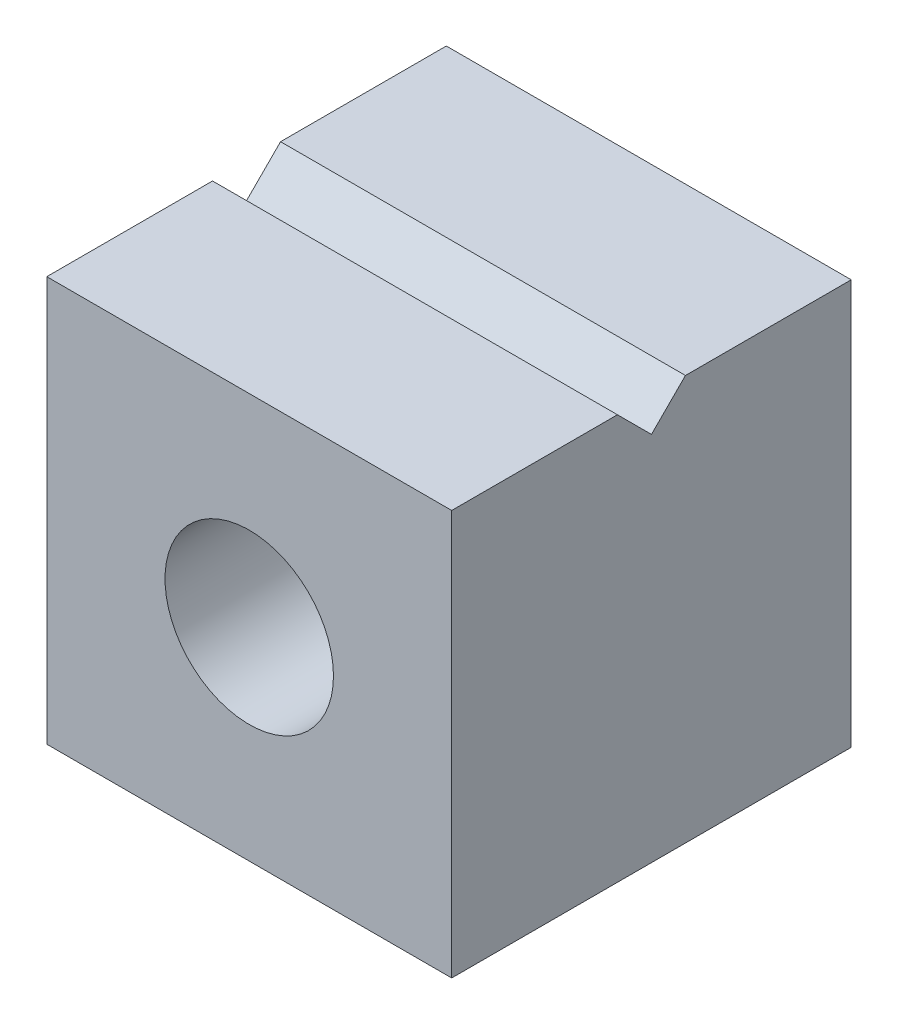
ISO-10303-21;
HEADER;
FILE_DESCRIPTION(('STEP AP214'),'2;1');
FILE_NAME('part.step','',(''),(''),'','','');
FILE_SCHEMA(('AUTOMOTIVE_DESIGN { 1 0 10303 214 1 1 1 1 }'));
ENDSEC;
DATA;
#1=APPLICATION_CONTEXT('core data for automotive mechanical design processes');
#2=APPLICATION_PROTOCOL_DEFINITION('international standard','automotive_design',2000,#1);
#3=PRODUCT_CONTEXT('',#1,'mechanical');
#4=PRODUCT('Part','Part','',(#3));
#5=PRODUCT_RELATED_PRODUCT_CATEGORY('part','',(#4));
#6=PRODUCT_DEFINITION_FORMATION('','',#4);
#7=PRODUCT_DEFINITION_CONTEXT('part definition',#1,'design');
#8=PRODUCT_DEFINITION('design','',#6,#7);
#9=PRODUCT_DEFINITION_SHAPE('','',#8);
#10=(LENGTH_UNIT() NAMED_UNIT(*) SI_UNIT(.MILLI.,.METRE.));
#11=(NAMED_UNIT(*) PLANE_ANGLE_UNIT() SI_UNIT($,.RADIAN.));
#12=(NAMED_UNIT(*) SI_UNIT($,.STERADIAN.) SOLID_ANGLE_UNIT());
#13=UNCERTAINTY_MEASURE_WITH_UNIT(LENGTH_MEASURE(1.E-05),#10,'distance_accuracy_value','');
#14=(GEOMETRIC_REPRESENTATION_CONTEXT(3) GLOBAL_UNCERTAINTY_ASSIGNED_CONTEXT((#13)) GLOBAL_UNIT_ASSIGNED_CONTEXT((#10,
#11,#12)) REPRESENTATION_CONTEXT('',''));
#15=CARTESIAN_POINT('',(0.,0.,0.));
#16=DIRECTION('',(0.,0.,1.));
#17=DIRECTION('',(1.,0.,0.));
#18=AXIS2_PLACEMENT_3D('',#15,#16,#17);
#19=CARTESIAN_POINT('',(-3.75,3.75,7.4));
#20=DIRECTION('',(0.,-1.,0.));
#21=DIRECTION('',(0.,0.,-1.));
#22=AXIS2_PLACEMENT_3D('',#19,#20,#21);
#23=PLANE('',#22);
#24=DIRECTION('',(0.,0.,-1.));
#25=VECTOR('',#24,1.);
#26=CARTESIAN_POINT('',(-3.75,3.75,7.4));
#27=LINE('',#26,#25);
#28=CARTESIAN_POINT('',(-3.75,3.75,3.07));
#29=VERTEX_POINT('',#28);
#30=CARTESIAN_POINT('',(-3.75,3.75,0.));
#31=VERTEX_POINT('',#30);
#32=EDGE_CURVE('E120',#29,#31,#27,.T.);
#33=ORIENTED_EDGE('',*,*,#32,.F.);
#34=DIRECTION('',(1.,0.,0.));
#35=VECTOR('',#34,1.);
#36=CARTESIAN_POINT('',(-3.75,3.75,3.07));
#37=LINE('',#36,#35);
#38=CARTESIAN_POINT('',(3.75,3.75,3.07));
#39=VERTEX_POINT('',#38);
#40=EDGE_CURVE('E106',#29,#39,#37,.T.);
#41=ORIENTED_EDGE('',*,*,#40,.T.);
#42=DIRECTION('',(0.,0.,-1.));
#43=VECTOR('',#42,1.);
#44=CARTESIAN_POINT('',(3.75,3.75,7.4));
#45=LINE('',#44,#43);
#46=CARTESIAN_POINT('',(3.75,3.75,0.));
#47=VERTEX_POINT('',#46);
#48=EDGE_CURVE('E48',#39,#47,#45,.T.);
#49=ORIENTED_EDGE('',*,*,#48,.T.);
#50=DIRECTION('',(-1.,0.,0.));
#51=VECTOR('',#50,1.);
#52=CARTESIAN_POINT('',(-3.75,3.75,0.));
#53=LINE('',#52,#51);
#54=EDGE_CURVE('E127',#47,#31,#53,.T.);
#55=ORIENTED_EDGE('',*,*,#54,.T.);
#56=EDGE_LOOP('',(#33,#41,#49,#55));
#57=FACE_BOUND('',#56,.T.);
#58=ADVANCED_FACE('F39',(#57),#23,.F.);
#59=CARTESIAN_POINT('',(0.,0.,7.4));
#60=DIRECTION('',(0.,0.,-1.));
#61=DIRECTION('',(-1.,0.,0.));
#62=AXIS2_PLACEMENT_3D('',#59,#60,#61);
#63=PLANE('',#62);
#64=DIRECTION('',(0.,1.,0.));
#65=VECTOR('',#64,1.);
#66=CARTESIAN_POINT('',(3.75,-3.75,7.4));
#67=LINE('',#66,#65);
#68=CARTESIAN_POINT('',(3.75,-3.75,7.4));
#69=VERTEX_POINT('',#68);
#70=CARTESIAN_POINT('',(3.75,3.75,7.4));
#71=VERTEX_POINT('',#70);
#72=EDGE_CURVE('E141',#69,#71,#67,.T.);
#73=ORIENTED_EDGE('',*,*,#72,.T.);
#74=DIRECTION('',(-1.,0.,0.));
#75=VECTOR('',#74,1.);
#76=CARTESIAN_POINT('',(-3.75,3.75,7.4));
#77=LINE('',#76,#75);
#78=CARTESIAN_POINT('',(-3.75,3.75,7.4));
#79=VERTEX_POINT('',#78);
#80=EDGE_CURVE('E92',#71,#79,#77,.T.);
#81=ORIENTED_EDGE('',*,*,#80,.T.);
#82=DIRECTION('',(0.,-1.,0.));
#83=VECTOR('',#82,1.);
#84=CARTESIAN_POINT('',(-3.75,-3.75,7.4));
#85=LINE('',#84,#83);
#86=CARTESIAN_POINT('',(-3.75,-3.75,7.4));
#87=VERTEX_POINT('',#86);
#88=EDGE_CURVE('E154',#79,#87,#85,.T.);
#89=ORIENTED_EDGE('',*,*,#88,.T.);
#90=DIRECTION('',(1.,0.,0.));
#91=VECTOR('',#90,1.);
#92=CARTESIAN_POINT('',(-3.75,-3.75,7.4));
#93=LINE('',#92,#91);
#94=EDGE_CURVE('E64',#87,#69,#93,.T.);
#95=ORIENTED_EDGE('',*,*,#94,.T.);
#96=EDGE_LOOP('',(#73,#81,#89,#95));
#97=FACE_BOUND('',#96,.T.);
#98=CARTESIAN_POINT('',(0.,0.,7.4));
#99=DIRECTION('',(0.,0.,1.));
#100=DIRECTION('',(1.,0.,0.));
#101=AXIS2_PLACEMENT_3D('',#98,#99,#100);
#102=CIRCLE('',#101,1.56);
#103=CARTESIAN_POINT('',(1.56,0.,7.4));
#104=VERTEX_POINT('',#103);
#105=EDGE_CURVE('E151',#104,#104,#102,.T.);
#106=ORIENTED_EDGE('',*,*,#105,.F.);
#107=EDGE_LOOP('',(#106));
#108=FACE_BOUND('',#107,.T.);
#109=ADVANCED_FACE('F194',(#97,#108),#63,.F.);
#110=CARTESIAN_POINT('',(0.,0.,0.));
#111=DIRECTION('',(0.,0.,-1.));
#112=DIRECTION('',(-1.,0.,0.));
#113=AXIS2_PLACEMENT_3D('',#110,#111,#112);
#114=PLANE('',#113);
#115=DIRECTION('',(0.,1.,0.));
#116=VECTOR('',#115,1.);
#117=CARTESIAN_POINT('',(3.75,-3.75,0.));
#118=LINE('',#117,#116);
#119=CARTESIAN_POINT('',(3.75,-3.75,0.));
#120=VERTEX_POINT('',#119);
#121=EDGE_CURVE('E147',#120,#47,#118,.T.);
#122=ORIENTED_EDGE('',*,*,#121,.F.);
#123=DIRECTION('',(1.,0.,0.));
#124=VECTOR('',#123,1.);
#125=CARTESIAN_POINT('',(-3.75,-3.75,0.));
#126=LINE('',#125,#124);
#127=CARTESIAN_POINT('',(-3.75,-3.75,0.));
#128=VERTEX_POINT('',#127);
#129=EDGE_CURVE('E85',#128,#120,#126,.T.);
#130=ORIENTED_EDGE('',*,*,#129,.F.);
#131=DIRECTION('',(0.,-1.,0.));
#132=VECTOR('',#131,1.);
#133=CARTESIAN_POINT('',(-3.75,-3.75,0.));
#134=LINE('',#133,#132);
#135=EDGE_CURVE('E142',#31,#128,#134,.T.);
#136=ORIENTED_EDGE('',*,*,#135,.F.);
#137=ORIENTED_EDGE('',*,*,#54,.F.);
#138=EDGE_LOOP('',(#122,#130,#136,#137));
#139=FACE_BOUND('',#138,.T.);
#140=CARTESIAN_POINT('',(0.,0.,0.));
#141=DIRECTION('',(0.,0.,1.));
#142=DIRECTION('',(1.,0.,0.));
#143=AXIS2_PLACEMENT_3D('',#140,#141,#142);
#144=CIRCLE('',#143,1.56);
#145=CARTESIAN_POINT('',(1.56,0.,0.));
#146=VERTEX_POINT('',#145);
#147=EDGE_CURVE('E161',#146,#146,#144,.T.);
#148=ORIENTED_EDGE('',*,*,#147,.T.);
#149=EDGE_LOOP('',(#148));
#150=FACE_BOUND('',#149,.T.);
#151=ADVANCED_FACE('F188',(#139,#150),#114,.T.);
#152=CARTESIAN_POINT('',(3.75,-3.75,7.4));
#153=DIRECTION('',(-1.,0.,0.));
#154=DIRECTION('',(0.,0.,1.));
#155=AXIS2_PLACEMENT_3D('',#152,#153,#154);
#156=PLANE('',#155);
#157=ORIENTED_EDGE('',*,*,#48,.F.);
#158=DIRECTION('',(0.,0.707106781186547,-0.707106781186548));
#159=VECTOR('',#158,1.);
#160=CARTESIAN_POINT('',(3.75,3.12,3.7));
#161=LINE('',#160,#159);
#162=CARTESIAN_POINT('',(3.75,3.12,3.7));
#163=VERTEX_POINT('',#162);
#164=EDGE_CURVE('E109',#163,#39,#161,.T.);
#165=ORIENTED_EDGE('',*,*,#164,.F.);
#166=DIRECTION('',(0.,-0.707106781186547,-0.707106781186548));
#167=VECTOR('',#166,1.);
#168=CARTESIAN_POINT('',(3.75,3.12,3.7));
#169=LINE('',#168,#167);
#170=CARTESIAN_POINT('',(3.75,3.75,4.33));
#171=VERTEX_POINT('',#170);
#172=EDGE_CURVE('E124',#171,#163,#169,.T.);
#173=ORIENTED_EDGE('',*,*,#172,.F.);
#174=EDGE_CURVE('E11',#71,#171,#45,.T.);
#175=ORIENTED_EDGE('',*,*,#174,.F.);
#176=ORIENTED_EDGE('',*,*,#72,.F.);
#177=DIRECTION('',(0.,0.,-1.));
#178=VECTOR('',#177,1.);
#179=CARTESIAN_POINT('',(3.75,-3.75,7.4));
#180=LINE('',#179,#178);
#181=EDGE_CURVE('E134',#69,#120,#180,.T.);
#182=ORIENTED_EDGE('',*,*,#181,.T.);
#183=ORIENTED_EDGE('',*,*,#121,.T.);
#184=EDGE_LOOP('',(#157,#165,#173,#175,#176,#182,#183));
#185=FACE_BOUND('',#184,.T.);
#186=ADVANCED_FACE('F41',(#185),#156,.F.);
#187=ORIENTED_EDGE('',*,*,#174,.T.);
#188=DIRECTION('',(1.,0.,0.));
#189=VECTOR('',#188,1.);
#190=CARTESIAN_POINT('',(-3.75,3.75,4.33));
#191=LINE('',#190,#189);
#192=CARTESIAN_POINT('',(-3.75,3.75,4.33));
#193=VERTEX_POINT('',#192);
#194=EDGE_CURVE('E114',#193,#171,#191,.T.);
#195=ORIENTED_EDGE('',*,*,#194,.F.);
#196=EDGE_CURVE('E130',#79,#193,#27,.T.);
#197=ORIENTED_EDGE('',*,*,#196,.F.);
#198=ORIENTED_EDGE('',*,*,#80,.F.);
#199=EDGE_LOOP('',(#187,#195,#197,#198));
#200=FACE_BOUND('',#199,.T.);
#201=ADVANCED_FACE('F196',(#200),#23,.F.);
#202=CARTESIAN_POINT('',(-3.75,-3.75,7.4));
#203=DIRECTION('',(1.,0.,0.));
#204=DIRECTION('',(0.,0.,-1.));
#205=AXIS2_PLACEMENT_3D('',#202,#203,#204);
#206=PLANE('',#205);
#207=DIRECTION('',(0.,-0.707106781186547,-0.707106781186548));
#208=VECTOR('',#207,1.);
#209=CARTESIAN_POINT('',(-3.75,3.12,3.7));
#210=LINE('',#209,#208);
#211=CARTESIAN_POINT('',(-3.75,3.12,3.7));
#212=VERTEX_POINT('',#211);
#213=EDGE_CURVE('E115',#193,#212,#210,.T.);
#214=ORIENTED_EDGE('',*,*,#213,.T.);
#215=DIRECTION('',(0.,0.707106781186547,-0.707106781186548));
#216=VECTOR('',#215,1.);
#217=CARTESIAN_POINT('',(-3.75,3.12,3.7));
#218=LINE('',#217,#216);
#219=EDGE_CURVE('E55',#212,#29,#218,.T.);
#220=ORIENTED_EDGE('',*,*,#219,.T.);
#221=ORIENTED_EDGE('',*,*,#32,.T.);
#222=ORIENTED_EDGE('',*,*,#135,.T.);
#223=DIRECTION('',(0.,0.,-1.));
#224=VECTOR('',#223,1.);
#225=CARTESIAN_POINT('',(-3.75,-3.75,7.4));
#226=LINE('',#225,#224);
#227=EDGE_CURVE('E131',#87,#128,#226,.T.);
#228=ORIENTED_EDGE('',*,*,#227,.F.);
#229=ORIENTED_EDGE('',*,*,#88,.F.);
#230=ORIENTED_EDGE('',*,*,#196,.T.);
#231=EDGE_LOOP('',(#214,#220,#221,#222,#228,#229,#230));
#232=FACE_BOUND('',#231,.T.);
#233=ADVANCED_FACE('F119',(#232),#206,.F.);
#234=CARTESIAN_POINT('',(-3.75,-3.75,7.4));
#235=DIRECTION('',(0.,1.,0.));
#236=DIRECTION('',(0.,0.,1.));
#237=AXIS2_PLACEMENT_3D('',#234,#235,#236);
#238=PLANE('',#237);
#239=ORIENTED_EDGE('',*,*,#129,.T.);
#240=ORIENTED_EDGE('',*,*,#181,.F.);
#241=ORIENTED_EDGE('',*,*,#94,.F.);
#242=ORIENTED_EDGE('',*,*,#227,.T.);
#243=EDGE_LOOP('',(#239,#240,#241,#242));
#244=FACE_BOUND('',#243,.T.);
#245=ADVANCED_FACE('F192',(#244),#238,.F.);
#246=CARTESIAN_POINT('',(0.,0.,7.4));
#247=DIRECTION('',(0.,0.,-1.));
#248=DIRECTION('',(-1.,0.,0.));
#249=AXIS2_PLACEMENT_3D('',#246,#247,#248);
#250=CYLINDRICAL_SURFACE('',#249,1.56);
#251=ORIENTED_EDGE('',*,*,#105,.T.);
#252=EDGE_LOOP('',(#251));
#253=FACE_BOUND('',#252,.T.);
#254=ORIENTED_EDGE('',*,*,#147,.F.);
#255=EDGE_LOOP('',(#254));
#256=FACE_BOUND('',#255,.T.);
#257=ADVANCED_FACE('F213',(#253,#256),#250,.F.);
#258=CARTESIAN_POINT('',(-3.75,3.12,3.7));
#259=DIRECTION('',(0.,-0.707106781186549,-0.707106781186547));
#260=DIRECTION('',(0.,0.707106781186547,-0.707106781186549));
#261=AXIS2_PLACEMENT_3D('',#258,#259,#260);
#262=PLANE('',#261);
#263=ORIENTED_EDGE('',*,*,#164,.T.);
#264=ORIENTED_EDGE('',*,*,#40,.F.);
#265=ORIENTED_EDGE('',*,*,#219,.F.);
#266=DIRECTION('',(1.,0.,0.));
#267=VECTOR('',#266,1.);
#268=CARTESIAN_POINT('',(-3.75,3.12,3.7));
#269=LINE('',#268,#267);
#270=EDGE_CURVE('E165',#212,#163,#269,.T.);
#271=ORIENTED_EDGE('',*,*,#270,.T.);
#272=EDGE_LOOP('',(#263,#264,#265,#271));
#273=FACE_BOUND('',#272,.T.);
#274=ADVANCED_FACE('F107',(#273),#262,.F.);
#275=CARTESIAN_POINT('',(-3.75,3.12,3.7));
#276=DIRECTION('',(0.,-0.707106781186549,0.707106781186547));
#277=DIRECTION('',(0.,-0.707106781186547,-0.707106781186549));
#278=AXIS2_PLACEMENT_3D('',#275,#276,#277);
#279=PLANE('',#278);
#280=ORIENTED_EDGE('',*,*,#172,.T.);
#281=ORIENTED_EDGE('',*,*,#270,.F.);
#282=ORIENTED_EDGE('',*,*,#213,.F.);
#283=ORIENTED_EDGE('',*,*,#194,.T.);
#284=EDGE_LOOP('',(#280,#281,#282,#283));
#285=FACE_BOUND('',#284,.T.);
#286=ADVANCED_FACE('F181',(#285),#279,.F.);
#287=CLOSED_SHELL('',(#58,#109,#151,#186,#201,#233,#245,#257,#274,#286));
#288=MANIFOLD_SOLID_BREP('B2',#287);
#289=ADVANCED_BREP_SHAPE_REPRESENTATION('',(#18,#288),#14);
#290=SHAPE_DEFINITION_REPRESENTATION(#9,#289);
ENDSEC;
END-ISO-10303-21;
